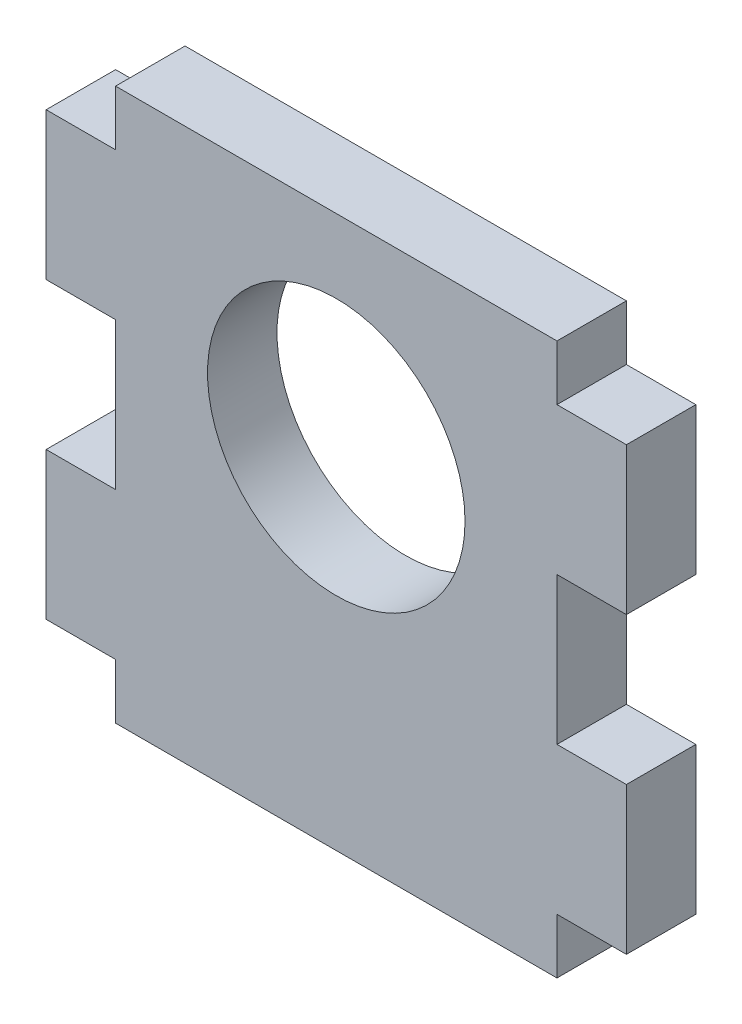
ISO-10303-21;
HEADER;
FILE_DESCRIPTION(('STEP AP214'),'2;1');
FILE_NAME('part.step','',(''),(''),'','','');
FILE_SCHEMA(('AUTOMOTIVE_DESIGN { 1 0 10303 214 1 1 1 1 }'));
ENDSEC;
DATA;
#1=APPLICATION_CONTEXT('core data for automotive mechanical design processes');
#2=APPLICATION_PROTOCOL_DEFINITION('international standard','automotive_design',2000,#1);
#3=PRODUCT_CONTEXT('',#1,'mechanical');
#4=PRODUCT('Part','Part','',(#3));
#5=PRODUCT_RELATED_PRODUCT_CATEGORY('part','',(#4));
#6=PRODUCT_DEFINITION_FORMATION('','',#4);
#7=PRODUCT_DEFINITION_CONTEXT('part definition',#1,'design');
#8=PRODUCT_DEFINITION('design','',#6,#7);
#9=PRODUCT_DEFINITION_SHAPE('','',#8);
#10=(LENGTH_UNIT() NAMED_UNIT(*) SI_UNIT(.MILLI.,.METRE.));
#11=(NAMED_UNIT(*) PLANE_ANGLE_UNIT() SI_UNIT($,.RADIAN.));
#12=(NAMED_UNIT(*) SI_UNIT($,.STERADIAN.) SOLID_ANGLE_UNIT());
#13=UNCERTAINTY_MEASURE_WITH_UNIT(LENGTH_MEASURE(1.E-05),#10,'distance_accuracy_value','');
#14=(GEOMETRIC_REPRESENTATION_CONTEXT(3) GLOBAL_UNCERTAINTY_ASSIGNED_CONTEXT((#13)) GLOBAL_UNIT_ASSIGNED_CONTEXT((#10,
#11,#12)) REPRESENTATION_CONTEXT('',''));
#15=CARTESIAN_POINT('',(0.,0.,0.));
#16=DIRECTION('',(0.,0.,1.));
#17=DIRECTION('',(1.,0.,0.));
#18=AXIS2_PLACEMENT_3D('',#15,#16,#17);
#19=CARTESIAN_POINT('',(0.,0.,5.9944));
#20=DIRECTION('',(0.,0.,1.));
#21=DIRECTION('',(1.,0.,0.));
#22=AXIS2_PLACEMENT_3D('',#19,#20,#21);
#23=PLANE('',#22);
#24=DIRECTION('',(1.,0.,0.));
#25=VECTOR('',#24,1.);
#26=CARTESIAN_POINT('',(-19.05,17.4625,5.9944));
#27=LINE('',#26,#25);
#28=CARTESIAN_POINT('',(-19.05,17.4625,5.9944));
#29=VERTEX_POINT('',#28);
#30=CARTESIAN_POINT('',(19.05,17.4625,5.9944));
#31=VERTEX_POINT('',#30);
#32=EDGE_CURVE('E176',#29,#31,#27,.T.);
#33=ORIENTED_EDGE('',*,*,#32,.F.);
#34=DIRECTION('',(0.,-1.,0.));
#35=VECTOR('',#34,1.);
#36=CARTESIAN_POINT('',(-19.05,19.05,5.9944));
#37=LINE('',#36,#35);
#38=CARTESIAN_POINT('',(-19.05,12.7,5.9944));
#39=VERTEX_POINT('',#38);
#40=EDGE_CURVE('E361',#29,#39,#37,.T.);
#41=ORIENTED_EDGE('',*,*,#40,.T.);
#42=DIRECTION('',(-1.,0.,0.));
#43=VECTOR('',#42,1.);
#44=CARTESIAN_POINT('',(-19.05,12.7,5.9944));
#45=LINE('',#44,#43);
#46=CARTESIAN_POINT('',(-25.0444,12.7,5.9944));
#47=VERTEX_POINT('',#46);
#48=EDGE_CURVE('E441',#39,#47,#45,.T.);
#49=ORIENTED_EDGE('',*,*,#48,.T.);
#50=DIRECTION('',(0.,-1.,0.));
#51=VECTOR('',#50,1.);
#52=CARTESIAN_POINT('',(-25.0444,12.7,5.9944));
#53=LINE('',#52,#51);
#54=CARTESIAN_POINT('',(-25.0444,0.,5.9944));
#55=VERTEX_POINT('',#54);
#56=EDGE_CURVE('E288',#47,#55,#53,.T.);
#57=ORIENTED_EDGE('',*,*,#56,.T.);
#58=DIRECTION('',(1.,0.,0.));
#59=VECTOR('',#58,1.);
#60=CARTESIAN_POINT('',(-19.05,0.,5.9944));
#61=LINE('',#60,#59);
#62=CARTESIAN_POINT('',(-19.05,0.,5.9944));
#63=VERTEX_POINT('',#62);
#64=EDGE_CURVE('E307',#55,#63,#61,.T.);
#65=ORIENTED_EDGE('',*,*,#64,.T.);
#66=DIRECTION('',(0.,-1.,0.));
#67=VECTOR('',#66,1.);
#68=CARTESIAN_POINT('',(-19.05,0.,5.9944));
#69=LINE('',#68,#67);
#70=CARTESIAN_POINT('',(-19.05,-12.7,5.9944));
#71=VERTEX_POINT('',#70);
#72=EDGE_CURVE('E302',#63,#71,#69,.T.);
#73=ORIENTED_EDGE('',*,*,#72,.T.);
#74=DIRECTION('',(-1.,0.,0.));
#75=VECTOR('',#74,1.);
#76=CARTESIAN_POINT('',(-19.05,-12.7,5.9944));
#77=LINE('',#76,#75);
#78=CARTESIAN_POINT('',(-25.0444,-12.7,5.9944));
#79=VERTEX_POINT('',#78);
#80=EDGE_CURVE('E306',#71,#79,#77,.T.);
#81=ORIENTED_EDGE('',*,*,#80,.T.);
#82=DIRECTION('',(0.,-1.,0.));
#83=VECTOR('',#82,1.);
#84=CARTESIAN_POINT('',(-25.0444,-25.4,5.9944));
#85=LINE('',#84,#83);
#86=CARTESIAN_POINT('',(-25.0444,-25.4,5.9944));
#87=VERTEX_POINT('',#86);
#88=EDGE_CURVE('E311',#79,#87,#85,.T.);
#89=ORIENTED_EDGE('',*,*,#88,.T.);
#90=DIRECTION('',(1.,0.,0.));
#91=VECTOR('',#90,1.);
#92=CARTESIAN_POINT('',(-19.05,-25.4,5.9944));
#93=LINE('',#92,#91);
#94=CARTESIAN_POINT('',(-19.05,-25.4,5.9944));
#95=VERTEX_POINT('',#94);
#96=EDGE_CURVE('E329',#87,#95,#93,.T.);
#97=ORIENTED_EDGE('',*,*,#96,.T.);
#98=DIRECTION('',(0.,-1.,0.));
#99=VECTOR('',#98,1.);
#100=CARTESIAN_POINT('',(-19.05,-25.4,5.9944));
#101=LINE('',#100,#99);
#102=CARTESIAN_POINT('',(-19.05,-30.1625,5.9944));
#103=VERTEX_POINT('',#102);
#104=EDGE_CURVE('E333',#95,#103,#101,.T.);
#105=ORIENTED_EDGE('',*,*,#104,.T.);
#106=DIRECTION('',(-1.,0.,0.));
#107=VECTOR('',#106,1.);
#108=CARTESIAN_POINT('',(-19.05,-30.1625,5.9944));
#109=LINE('',#108,#107);
#110=CARTESIAN_POINT('',(19.05,-30.1625,5.9944));
#111=VERTEX_POINT('',#110);
#112=EDGE_CURVE('E181',#111,#103,#109,.T.);
#113=ORIENTED_EDGE('',*,*,#112,.F.);
#114=DIRECTION('',(0.,1.,0.));
#115=VECTOR('',#114,1.);
#116=CARTESIAN_POINT('',(19.05,-25.4,5.9944));
#117=LINE('',#116,#115);
#118=CARTESIAN_POINT('',(19.05,-25.4,5.9944));
#119=VERTEX_POINT('',#118);
#120=EDGE_CURVE('E338',#111,#119,#117,.T.);
#121=ORIENTED_EDGE('',*,*,#120,.T.);
#122=DIRECTION('',(1.,0.,0.));
#123=VECTOR('',#122,1.);
#124=CARTESIAN_POINT('',(19.05,-25.4,5.9944));
#125=LINE('',#124,#123);
#126=CARTESIAN_POINT('',(25.0444,-25.4,5.9944));
#127=VERTEX_POINT('',#126);
#128=EDGE_CURVE('E388',#119,#127,#125,.T.);
#129=ORIENTED_EDGE('',*,*,#128,.T.);
#130=DIRECTION('',(0.,1.,0.));
#131=VECTOR('',#130,1.);
#132=CARTESIAN_POINT('',(25.0444,-25.4,5.9944));
#133=LINE('',#132,#131);
#134=CARTESIAN_POINT('',(25.0444,-12.7,5.9944));
#135=VERTEX_POINT('',#134);
#136=EDGE_CURVE('E385',#127,#135,#133,.T.);
#137=ORIENTED_EDGE('',*,*,#136,.T.);
#138=DIRECTION('',(-1.,0.,0.));
#139=VECTOR('',#138,1.);
#140=CARTESIAN_POINT('',(19.05,-12.7,5.9944));
#141=LINE('',#140,#139);
#142=CARTESIAN_POINT('',(19.05,-12.7,5.9944));
#143=VERTEX_POINT('',#142);
#144=EDGE_CURVE('E380',#135,#143,#141,.T.);
#145=ORIENTED_EDGE('',*,*,#144,.T.);
#146=DIRECTION('',(0.,1.,0.));
#147=VECTOR('',#146,1.);
#148=CARTESIAN_POINT('',(19.05,0.,5.9944));
#149=LINE('',#148,#147);
#150=CARTESIAN_POINT('',(19.05,0.,5.9944));
#151=VERTEX_POINT('',#150);
#152=EDGE_CURVE('E376',#143,#151,#149,.T.);
#153=ORIENTED_EDGE('',*,*,#152,.T.);
#154=DIRECTION('',(1.,0.,0.));
#155=VECTOR('',#154,1.);
#156=CARTESIAN_POINT('',(19.05,0.,5.9944));
#157=LINE('',#156,#155);
#158=CARTESIAN_POINT('',(25.0444,0.,5.9944));
#159=VERTEX_POINT('',#158);
#160=EDGE_CURVE('E372',#151,#159,#157,.T.);
#161=ORIENTED_EDGE('',*,*,#160,.T.);
#162=DIRECTION('',(0.,1.,0.));
#163=VECTOR('',#162,1.);
#164=CARTESIAN_POINT('',(25.0444,12.7,5.9944));
#165=LINE('',#164,#163);
#166=CARTESIAN_POINT('',(25.0444,12.7,5.9944));
#167=VERTEX_POINT('',#166);
#168=EDGE_CURVE('E369',#159,#167,#165,.T.);
#169=ORIENTED_EDGE('',*,*,#168,.T.);
#170=DIRECTION('',(-1.,0.,0.));
#171=VECTOR('',#170,1.);
#172=CARTESIAN_POINT('',(19.05,12.7,5.9944));
#173=LINE('',#172,#171);
#174=CARTESIAN_POINT('',(19.05,12.7,5.9944));
#175=VERTEX_POINT('',#174);
#176=EDGE_CURVE('E205',#167,#175,#173,.T.);
#177=ORIENTED_EDGE('',*,*,#176,.T.);
#178=DIRECTION('',(0.,1.,0.));
#179=VECTOR('',#178,1.);
#180=CARTESIAN_POINT('',(19.05,19.05,5.9944));
#181=LINE('',#180,#179);
#182=EDGE_CURVE('E241',#175,#31,#181,.T.);
#183=ORIENTED_EDGE('',*,*,#182,.T.);
#184=EDGE_LOOP('',(#33,#41,#49,#57,#65,#73,#81,#89,#97,#105,#113,#121,#129,#137,#145,#153,#161,
#169,#177,#183));
#185=FACE_BOUND('',#184,.T.);
#186=CARTESIAN_POINT('',(0.,0.,5.9944));
#187=DIRECTION('',(0.,0.,1.));
#188=DIRECTION('',(1.,0.,0.));
#189=AXIS2_PLACEMENT_3D('',#186,#187,#188);
#190=CIRCLE('',#189,11.1125);
#191=CARTESIAN_POINT('',(11.1125,0.,5.9944));
#192=VERTEX_POINT('',#191);
#193=EDGE_CURVE('E197',#192,#192,#190,.T.);
#194=ORIENTED_EDGE('',*,*,#193,.F.);
#195=EDGE_LOOP('',(#194));
#196=FACE_BOUND('',#195,.T.);
#197=ADVANCED_FACE('F38',(#185,#196),#23,.T.);
#198=CARTESIAN_POINT('',(0.,0.,0.));
#199=DIRECTION('',(0.,0.,1.));
#200=DIRECTION('',(1.,0.,0.));
#201=AXIS2_PLACEMENT_3D('',#198,#199,#200);
#202=PLANE('',#201);
#203=DIRECTION('',(0.,-1.,0.));
#204=VECTOR('',#203,1.);
#205=CARTESIAN_POINT('',(-19.05,19.05,0.));
#206=LINE('',#205,#204);
#207=CARTESIAN_POINT('',(-19.05,17.4625,0.));
#208=VERTEX_POINT('',#207);
#209=CARTESIAN_POINT('',(-19.05,12.7,0.));
#210=VERTEX_POINT('',#209);
#211=EDGE_CURVE('E192',#208,#210,#206,.T.);
#212=ORIENTED_EDGE('',*,*,#211,.F.);
#213=DIRECTION('',(1.,0.,0.));
#214=VECTOR('',#213,1.);
#215=CARTESIAN_POINT('',(-19.05,17.4625,0.));
#216=LINE('',#215,#214);
#217=CARTESIAN_POINT('',(19.05,17.4625,0.));
#218=VERTEX_POINT('',#217);
#219=EDGE_CURVE('E53',#208,#218,#216,.T.);
#220=ORIENTED_EDGE('',*,*,#219,.T.);
#221=DIRECTION('',(0.,1.,0.));
#222=VECTOR('',#221,1.);
#223=CARTESIAN_POINT('',(19.05,19.05,0.));
#224=LINE('',#223,#222);
#225=CARTESIAN_POINT('',(19.05,12.7,0.));
#226=VERTEX_POINT('',#225);
#227=EDGE_CURVE('E190',#226,#218,#224,.T.);
#228=ORIENTED_EDGE('',*,*,#227,.F.);
#229=DIRECTION('',(-1.,0.,0.));
#230=VECTOR('',#229,1.);
#231=CARTESIAN_POINT('',(19.05,12.7,0.));
#232=LINE('',#231,#230);
#233=CARTESIAN_POINT('',(25.0444,12.7,0.));
#234=VERTEX_POINT('',#233);
#235=EDGE_CURVE('E239',#234,#226,#232,.T.);
#236=ORIENTED_EDGE('',*,*,#235,.F.);
#237=DIRECTION('',(0.,1.,0.));
#238=VECTOR('',#237,1.);
#239=CARTESIAN_POINT('',(25.0444,12.7,0.));
#240=LINE('',#239,#238);
#241=CARTESIAN_POINT('',(25.0444,0.,0.));
#242=VERTEX_POINT('',#241);
#243=EDGE_CURVE('E237',#242,#234,#240,.T.);
#244=ORIENTED_EDGE('',*,*,#243,.F.);
#245=DIRECTION('',(1.,0.,0.));
#246=VECTOR('',#245,1.);
#247=CARTESIAN_POINT('',(19.05,0.,0.));
#248=LINE('',#247,#246);
#249=CARTESIAN_POINT('',(19.05,0.,0.));
#250=VERTEX_POINT('',#249);
#251=EDGE_CURVE('E235',#250,#242,#248,.T.);
#252=ORIENTED_EDGE('',*,*,#251,.F.);
#253=DIRECTION('',(0.,1.,0.));
#254=VECTOR('',#253,1.);
#255=CARTESIAN_POINT('',(19.05,0.,0.));
#256=LINE('',#255,#254);
#257=CARTESIAN_POINT('',(19.05,-12.7,0.));
#258=VERTEX_POINT('',#257);
#259=EDGE_CURVE('E233',#258,#250,#256,.T.);
#260=ORIENTED_EDGE('',*,*,#259,.F.);
#261=DIRECTION('',(-1.,0.,0.));
#262=VECTOR('',#261,1.);
#263=CARTESIAN_POINT('',(19.05,-12.7,0.));
#264=LINE('',#263,#262);
#265=CARTESIAN_POINT('',(25.0444,-12.7,0.));
#266=VERTEX_POINT('',#265);
#267=EDGE_CURVE('E231',#266,#258,#264,.T.);
#268=ORIENTED_EDGE('',*,*,#267,.F.);
#269=DIRECTION('',(0.,1.,0.));
#270=VECTOR('',#269,1.);
#271=CARTESIAN_POINT('',(25.0444,-25.4,0.));
#272=LINE('',#271,#270);
#273=CARTESIAN_POINT('',(25.0444,-25.4,0.));
#274=VERTEX_POINT('',#273);
#275=EDGE_CURVE('E229',#274,#266,#272,.T.);
#276=ORIENTED_EDGE('',*,*,#275,.F.);
#277=DIRECTION('',(1.,0.,0.));
#278=VECTOR('',#277,1.);
#279=CARTESIAN_POINT('',(19.05,-25.4,0.));
#280=LINE('',#279,#278);
#281=CARTESIAN_POINT('',(19.05,-25.4,0.));
#282=VERTEX_POINT('',#281);
#283=EDGE_CURVE('E227',#282,#274,#280,.T.);
#284=ORIENTED_EDGE('',*,*,#283,.F.);
#285=DIRECTION('',(0.,1.,0.));
#286=VECTOR('',#285,1.);
#287=CARTESIAN_POINT('',(19.05,-25.4,0.));
#288=LINE('',#287,#286);
#289=CARTESIAN_POINT('',(19.05,-30.1625,0.));
#290=VERTEX_POINT('',#289);
#291=EDGE_CURVE('E225',#290,#282,#288,.T.);
#292=ORIENTED_EDGE('',*,*,#291,.F.);
#293=DIRECTION('',(-1.,0.,0.));
#294=VECTOR('',#293,1.);
#295=CARTESIAN_POINT('',(-19.05,-30.1625,0.));
#296=LINE('',#295,#294);
#297=CARTESIAN_POINT('',(-19.05,-30.1625,0.));
#298=VERTEX_POINT('',#297);
#299=EDGE_CURVE('E61',#290,#298,#296,.T.);
#300=ORIENTED_EDGE('',*,*,#299,.T.);
#301=DIRECTION('',(0.,-1.,0.));
#302=VECTOR('',#301,1.);
#303=CARTESIAN_POINT('',(-19.05,-25.4,0.));
#304=LINE('',#303,#302);
#305=CARTESIAN_POINT('',(-19.05,-25.4,0.));
#306=VERTEX_POINT('',#305);
#307=EDGE_CURVE('E222',#306,#298,#304,.T.);
#308=ORIENTED_EDGE('',*,*,#307,.F.);
#309=DIRECTION('',(1.,0.,0.));
#310=VECTOR('',#309,1.);
#311=CARTESIAN_POINT('',(-19.05,-25.4,0.));
#312=LINE('',#311,#310);
#313=CARTESIAN_POINT('',(-25.0444,-25.4,0.));
#314=VERTEX_POINT('',#313);
#315=EDGE_CURVE('E220',#314,#306,#312,.T.);
#316=ORIENTED_EDGE('',*,*,#315,.F.);
#317=DIRECTION('',(0.,-1.,0.));
#318=VECTOR('',#317,1.);
#319=CARTESIAN_POINT('',(-25.0444,-25.4,0.));
#320=LINE('',#319,#318);
#321=CARTESIAN_POINT('',(-25.0444,-12.7,0.));
#322=VERTEX_POINT('',#321);
#323=EDGE_CURVE('E218',#322,#314,#320,.T.);
#324=ORIENTED_EDGE('',*,*,#323,.F.);
#325=DIRECTION('',(-1.,0.,0.));
#326=VECTOR('',#325,1.);
#327=CARTESIAN_POINT('',(-19.05,-12.7,0.));
#328=LINE('',#327,#326);
#329=CARTESIAN_POINT('',(-19.05,-12.7,0.));
#330=VERTEX_POINT('',#329);
#331=EDGE_CURVE('E216',#330,#322,#328,.T.);
#332=ORIENTED_EDGE('',*,*,#331,.F.);
#333=DIRECTION('',(0.,-1.,0.));
#334=VECTOR('',#333,1.);
#335=CARTESIAN_POINT('',(-19.05,0.,0.));
#336=LINE('',#335,#334);
#337=CARTESIAN_POINT('',(-19.05,0.,0.));
#338=VERTEX_POINT('',#337);
#339=EDGE_CURVE('E214',#338,#330,#336,.T.);
#340=ORIENTED_EDGE('',*,*,#339,.F.);
#341=DIRECTION('',(1.,0.,0.));
#342=VECTOR('',#341,1.);
#343=CARTESIAN_POINT('',(-19.05,0.,0.));
#344=LINE('',#343,#342);
#345=CARTESIAN_POINT('',(-25.0444,0.,0.));
#346=VERTEX_POINT('',#345);
#347=EDGE_CURVE('E212',#346,#338,#344,.T.);
#348=ORIENTED_EDGE('',*,*,#347,.F.);
#349=DIRECTION('',(0.,-1.,0.));
#350=VECTOR('',#349,1.);
#351=CARTESIAN_POINT('',(-25.0444,12.7,0.));
#352=LINE('',#351,#350);
#353=CARTESIAN_POINT('',(-25.0444,12.7,0.));
#354=VERTEX_POINT('',#353);
#355=EDGE_CURVE('E210',#354,#346,#352,.T.);
#356=ORIENTED_EDGE('',*,*,#355,.F.);
#357=DIRECTION('',(-1.,0.,0.));
#358=VECTOR('',#357,1.);
#359=CARTESIAN_POINT('',(-19.05,12.7,0.));
#360=LINE('',#359,#358);
#361=EDGE_CURVE('E199',#210,#354,#360,.T.);
#362=ORIENTED_EDGE('',*,*,#361,.F.);
#363=EDGE_LOOP('',(#212,#220,#228,#236,#244,#252,#260,#268,#276,#284,#292,#300,#308,#316,#324,
#332,#340,#348,#356,#362));
#364=FACE_BOUND('',#363,.T.);
#365=CARTESIAN_POINT('',(0.,0.,0.));
#366=DIRECTION('',(0.,0.,1.));
#367=DIRECTION('',(1.,0.,0.));
#368=AXIS2_PLACEMENT_3D('',#365,#366,#367);
#369=CIRCLE('',#368,11.1125);
#370=CARTESIAN_POINT('',(11.1125,0.,0.));
#371=VERTEX_POINT('',#370);
#372=EDGE_CURVE('E203',#371,#371,#369,.T.);
#373=ORIENTED_EDGE('',*,*,#372,.T.);
#374=EDGE_LOOP('',(#373));
#375=FACE_BOUND('',#374,.T.);
#376=ADVANCED_FACE('F187',(#364,#375),#202,.F.);
#377=CARTESIAN_POINT('',(19.05,19.05,5.9944));
#378=DIRECTION('',(-1.,0.,0.));
#379=DIRECTION('',(0.,-1.,0.));
#380=AXIS2_PLACEMENT_3D('',#377,#378,#379);
#381=PLANE('',#380);
#382=ORIENTED_EDGE('',*,*,#227,.T.);
#383=DIRECTION('',(0.,0.,1.));
#384=VECTOR('',#383,1.);
#385=CARTESIAN_POINT('',(19.05,17.4625,0.));
#386=LINE('',#385,#384);
#387=EDGE_CURVE('E173',#218,#31,#386,.T.);
#388=ORIENTED_EDGE('',*,*,#387,.T.);
#389=ORIENTED_EDGE('',*,*,#182,.F.);
#390=DIRECTION('',(0.,0.,-1.));
#391=VECTOR('',#390,1.);
#392=CARTESIAN_POINT('',(19.05,12.7,5.9944));
#393=LINE('',#392,#391);
#394=EDGE_CURVE('E196',#175,#226,#393,.T.);
#395=ORIENTED_EDGE('',*,*,#394,.T.);
#396=EDGE_LOOP('',(#382,#388,#389,#395));
#397=FACE_BOUND('',#396,.T.);
#398=ADVANCED_FACE('F40',(#397),#381,.F.);
#399=CARTESIAN_POINT('',(-19.05,19.05,5.9944));
#400=DIRECTION('',(1.,0.,0.));
#401=DIRECTION('',(0.,1.,0.));
#402=AXIS2_PLACEMENT_3D('',#399,#400,#401);
#403=PLANE('',#402);
#404=ORIENTED_EDGE('',*,*,#40,.F.);
#405=DIRECTION('',(0.,0.,1.));
#406=VECTOR('',#405,1.);
#407=CARTESIAN_POINT('',(-19.05,17.4625,0.));
#408=LINE('',#407,#406);
#409=EDGE_CURVE('E182',#208,#29,#408,.T.);
#410=ORIENTED_EDGE('',*,*,#409,.F.);
#411=ORIENTED_EDGE('',*,*,#211,.T.);
#412=DIRECTION('',(0.,0.,-1.));
#413=VECTOR('',#412,1.);
#414=CARTESIAN_POINT('',(-19.05,12.7,5.9944));
#415=LINE('',#414,#413);
#416=EDGE_CURVE('E12',#39,#210,#415,.T.);
#417=ORIENTED_EDGE('',*,*,#416,.F.);
#418=EDGE_LOOP('',(#404,#410,#411,#417));
#419=FACE_BOUND('',#418,.T.);
#420=ADVANCED_FACE('F439',(#419),#403,.F.);
#421=CARTESIAN_POINT('',(-19.05,12.7,5.9944));
#422=DIRECTION('',(0.,-1.,0.));
#423=DIRECTION('',(0.,0.,-1.));
#424=AXIS2_PLACEMENT_3D('',#421,#422,#423);
#425=PLANE('',#424);
#426=ORIENTED_EDGE('',*,*,#361,.T.);
#427=DIRECTION('',(0.,0.,-1.));
#428=VECTOR('',#427,1.);
#429=CARTESIAN_POINT('',(-25.0444,12.7,5.9944));
#430=LINE('',#429,#428);
#431=EDGE_CURVE('E46',#47,#354,#430,.T.);
#432=ORIENTED_EDGE('',*,*,#431,.F.);
#433=ORIENTED_EDGE('',*,*,#48,.F.);
#434=ORIENTED_EDGE('',*,*,#416,.T.);
#435=EDGE_LOOP('',(#426,#432,#433,#434));
#436=FACE_BOUND('',#435,.T.);
#437=ADVANCED_FACE('F450',(#436),#425,.F.);
#438=CARTESIAN_POINT('',(-25.0444,12.7,5.9944));
#439=DIRECTION('',(1.,0.,0.));
#440=DIRECTION('',(0.,0.,-1.));
#441=AXIS2_PLACEMENT_3D('',#438,#439,#440);
#442=PLANE('',#441);
#443=ORIENTED_EDGE('',*,*,#355,.T.);
#444=DIRECTION('',(0.,0.,-1.));
#445=VECTOR('',#444,1.);
#446=CARTESIAN_POINT('',(-25.0444,0.,5.9944));
#447=LINE('',#446,#445);
#448=EDGE_CURVE('E279',#55,#346,#447,.T.);
#449=ORIENTED_EDGE('',*,*,#448,.F.);
#450=ORIENTED_EDGE('',*,*,#56,.F.);
#451=ORIENTED_EDGE('',*,*,#431,.T.);
#452=EDGE_LOOP('',(#443,#449,#450,#451));
#453=FACE_BOUND('',#452,.T.);
#454=ADVANCED_FACE('F286',(#453),#442,.F.);
#455=CARTESIAN_POINT('',(-19.05,0.,5.9944));
#456=DIRECTION('',(0.,1.,0.));
#457=DIRECTION('',(0.,0.,1.));
#458=AXIS2_PLACEMENT_3D('',#455,#456,#457);
#459=PLANE('',#458);
#460=ORIENTED_EDGE('',*,*,#347,.T.);
#461=DIRECTION('',(0.,0.,-1.));
#462=VECTOR('',#461,1.);
#463=CARTESIAN_POINT('',(-19.05,0.,5.9944));
#464=LINE('',#463,#462);
#465=EDGE_CURVE('E276',#63,#338,#464,.T.);
#466=ORIENTED_EDGE('',*,*,#465,.F.);
#467=ORIENTED_EDGE('',*,*,#64,.F.);
#468=ORIENTED_EDGE('',*,*,#448,.T.);
#469=EDGE_LOOP('',(#460,#466,#467,#468));
#470=FACE_BOUND('',#469,.T.);
#471=ADVANCED_FACE('F296',(#470),#459,.F.);
#472=CARTESIAN_POINT('',(-19.05,0.,5.9944));
#473=DIRECTION('',(1.,0.,0.));
#474=DIRECTION('',(0.,0.,-1.));
#475=AXIS2_PLACEMENT_3D('',#472,#473,#474);
#476=PLANE('',#475);
#477=ORIENTED_EDGE('',*,*,#339,.T.);
#478=DIRECTION('',(0.,0.,-1.));
#479=VECTOR('',#478,1.);
#480=CARTESIAN_POINT('',(-19.05,-12.7,5.9944));
#481=LINE('',#480,#479);
#482=EDGE_CURVE('E273',#71,#330,#481,.T.);
#483=ORIENTED_EDGE('',*,*,#482,.F.);
#484=ORIENTED_EDGE('',*,*,#72,.F.);
#485=ORIENTED_EDGE('',*,*,#465,.T.);
#486=EDGE_LOOP('',(#477,#483,#484,#485));
#487=FACE_BOUND('',#486,.T.);
#488=ADVANCED_FACE('F300',(#487),#476,.F.);
#489=CARTESIAN_POINT('',(-19.05,-12.7,5.9944));
#490=DIRECTION('',(0.,-1.,0.));
#491=DIRECTION('',(0.,0.,-1.));
#492=AXIS2_PLACEMENT_3D('',#489,#490,#491);
#493=PLANE('',#492);
#494=ORIENTED_EDGE('',*,*,#331,.T.);
#495=DIRECTION('',(0.,0.,-1.));
#496=VECTOR('',#495,1.);
#497=CARTESIAN_POINT('',(-25.0444,-12.7,5.9944));
#498=LINE('',#497,#496);
#499=EDGE_CURVE('E270',#79,#322,#498,.T.);
#500=ORIENTED_EDGE('',*,*,#499,.F.);
#501=ORIENTED_EDGE('',*,*,#80,.F.);
#502=ORIENTED_EDGE('',*,*,#482,.T.);
#503=EDGE_LOOP('',(#494,#500,#501,#502));
#504=FACE_BOUND('',#503,.T.);
#505=ADVANCED_FACE('F495',(#504),#493,.F.);
#506=CARTESIAN_POINT('',(-25.0444,-25.4,5.9944));
#507=DIRECTION('',(1.,0.,0.));
#508=DIRECTION('',(0.,0.,-1.));
#509=AXIS2_PLACEMENT_3D('',#506,#507,#508);
#510=PLANE('',#509);
#511=ORIENTED_EDGE('',*,*,#323,.T.);
#512=DIRECTION('',(0.,0.,-1.));
#513=VECTOR('',#512,1.);
#514=CARTESIAN_POINT('',(-25.0444,-25.4,5.9944));
#515=LINE('',#514,#513);
#516=EDGE_CURVE('E267',#87,#314,#515,.T.);
#517=ORIENTED_EDGE('',*,*,#516,.F.);
#518=ORIENTED_EDGE('',*,*,#88,.F.);
#519=ORIENTED_EDGE('',*,*,#499,.T.);
#520=EDGE_LOOP('',(#511,#517,#518,#519));
#521=FACE_BOUND('',#520,.T.);
#522=ADVANCED_FACE('F491',(#521),#510,.F.);
#523=CARTESIAN_POINT('',(-19.05,-25.4,5.9944));
#524=DIRECTION('',(0.,1.,0.));
#525=DIRECTION('',(0.,0.,1.));
#526=AXIS2_PLACEMENT_3D('',#523,#524,#525);
#527=PLANE('',#526);
#528=ORIENTED_EDGE('',*,*,#315,.T.);
#529=DIRECTION('',(0.,0.,-1.));
#530=VECTOR('',#529,1.);
#531=CARTESIAN_POINT('',(-19.05,-25.4,5.9944));
#532=LINE('',#531,#530);
#533=EDGE_CURVE('E264',#95,#306,#532,.T.);
#534=ORIENTED_EDGE('',*,*,#533,.F.);
#535=ORIENTED_EDGE('',*,*,#96,.F.);
#536=ORIENTED_EDGE('',*,*,#516,.T.);
#537=EDGE_LOOP('',(#528,#534,#535,#536));
#538=FACE_BOUND('',#537,.T.);
#539=ADVANCED_FACE('F487',(#538),#527,.F.);
#540=CARTESIAN_POINT('',(-19.05,-25.4,5.9944));
#541=DIRECTION('',(1.,0.,0.));
#542=DIRECTION('',(0.,1.,0.));
#543=AXIS2_PLACEMENT_3D('',#540,#541,#542);
#544=PLANE('',#543);
#545=ORIENTED_EDGE('',*,*,#307,.T.);
#546=DIRECTION('',(0.,0.,1.));
#547=VECTOR('',#546,1.);
#548=CARTESIAN_POINT('',(-19.05,-30.1625,0.));
#549=LINE('',#548,#547);
#550=EDGE_CURVE('E350',#298,#103,#549,.T.);
#551=ORIENTED_EDGE('',*,*,#550,.T.);
#552=ORIENTED_EDGE('',*,*,#104,.F.);
#553=ORIENTED_EDGE('',*,*,#533,.T.);
#554=EDGE_LOOP('',(#545,#551,#552,#553));
#555=FACE_BOUND('',#554,.T.);
#556=ADVANCED_FACE('F484',(#555),#544,.F.);
#557=CARTESIAN_POINT('',(19.05,-25.4,5.9944));
#558=DIRECTION('',(-1.,0.,0.));
#559=DIRECTION('',(0.,-1.,0.));
#560=AXIS2_PLACEMENT_3D('',#557,#558,#559);
#561=PLANE('',#560);
#562=ORIENTED_EDGE('',*,*,#120,.F.);
#563=DIRECTION('',(0.,0.,1.));
#564=VECTOR('',#563,1.);
#565=CARTESIAN_POINT('',(19.05,-30.1625,0.));
#566=LINE('',#565,#564);
#567=EDGE_CURVE('E353',#290,#111,#566,.T.);
#568=ORIENTED_EDGE('',*,*,#567,.F.);
#569=ORIENTED_EDGE('',*,*,#291,.T.);
#570=DIRECTION('',(0.,0.,-1.));
#571=VECTOR('',#570,1.);
#572=CARTESIAN_POINT('',(19.05,-25.4,5.9944));
#573=LINE('',#572,#571);
#574=EDGE_CURVE('E261',#119,#282,#573,.T.);
#575=ORIENTED_EDGE('',*,*,#574,.F.);
#576=EDGE_LOOP('',(#562,#568,#569,#575));
#577=FACE_BOUND('',#576,.T.);
#578=ADVANCED_FACE('F399',(#577),#561,.F.);
#579=CARTESIAN_POINT('',(19.05,-25.4,5.9944));
#580=DIRECTION('',(0.,1.,0.));
#581=DIRECTION('',(0.,0.,1.));
#582=AXIS2_PLACEMENT_3D('',#579,#580,#581);
#583=PLANE('',#582);
#584=ORIENTED_EDGE('',*,*,#283,.T.);
#585=DIRECTION('',(0.,0.,-1.));
#586=VECTOR('',#585,1.);
#587=CARTESIAN_POINT('',(25.0444,-25.4,5.9944));
#588=LINE('',#587,#586);
#589=EDGE_CURVE('E258',#127,#274,#588,.T.);
#590=ORIENTED_EDGE('',*,*,#589,.F.);
#591=ORIENTED_EDGE('',*,*,#128,.F.);
#592=ORIENTED_EDGE('',*,*,#574,.T.);
#593=EDGE_LOOP('',(#584,#590,#591,#592));
#594=FACE_BOUND('',#593,.T.);
#595=ADVANCED_FACE('F403',(#594),#583,.F.);
#596=CARTESIAN_POINT('',(25.0444,-25.4,5.9944));
#597=DIRECTION('',(-1.,0.,0.));
#598=DIRECTION('',(0.,-1.,0.));
#599=AXIS2_PLACEMENT_3D('',#596,#597,#598);
#600=PLANE('',#599);
#601=ORIENTED_EDGE('',*,*,#275,.T.);
#602=DIRECTION('',(0.,0.,-1.));
#603=VECTOR('',#602,1.);
#604=CARTESIAN_POINT('',(25.0444,-12.7,5.9944));
#605=LINE('',#604,#603);
#606=EDGE_CURVE('E255',#135,#266,#605,.T.);
#607=ORIENTED_EDGE('',*,*,#606,.F.);
#608=ORIENTED_EDGE('',*,*,#136,.F.);
#609=ORIENTED_EDGE('',*,*,#589,.T.);
#610=EDGE_LOOP('',(#601,#607,#608,#609));
#611=FACE_BOUND('',#610,.T.);
#612=ADVANCED_FACE('F408',(#611),#600,.F.);
#613=CARTESIAN_POINT('',(19.05,-12.7,5.9944));
#614=DIRECTION('',(0.,-1.,0.));
#615=DIRECTION('',(0.,0.,-1.));
#616=AXIS2_PLACEMENT_3D('',#613,#614,#615);
#617=PLANE('',#616);
#618=ORIENTED_EDGE('',*,*,#267,.T.);
#619=DIRECTION('',(0.,0.,-1.));
#620=VECTOR('',#619,1.);
#621=CARTESIAN_POINT('',(19.05,-12.7,5.9944));
#622=LINE('',#621,#620);
#623=EDGE_CURVE('E252',#143,#258,#622,.T.);
#624=ORIENTED_EDGE('',*,*,#623,.F.);
#625=ORIENTED_EDGE('',*,*,#144,.F.);
#626=ORIENTED_EDGE('',*,*,#606,.T.);
#627=EDGE_LOOP('',(#618,#624,#625,#626));
#628=FACE_BOUND('',#627,.T.);
#629=ADVANCED_FACE('F415',(#628),#617,.F.);
#630=CARTESIAN_POINT('',(19.05,0.,5.9944));
#631=DIRECTION('',(-1.,0.,0.));
#632=DIRECTION('',(0.,0.,1.));
#633=AXIS2_PLACEMENT_3D('',#630,#631,#632);
#634=PLANE('',#633);
#635=ORIENTED_EDGE('',*,*,#259,.T.);
#636=DIRECTION('',(0.,0.,-1.));
#637=VECTOR('',#636,1.);
#638=CARTESIAN_POINT('',(19.05,0.,5.9944));
#639=LINE('',#638,#637);
#640=EDGE_CURVE('E249',#151,#250,#639,.T.);
#641=ORIENTED_EDGE('',*,*,#640,.F.);
#642=ORIENTED_EDGE('',*,*,#152,.F.);
#643=ORIENTED_EDGE('',*,*,#623,.T.);
#644=EDGE_LOOP('',(#635,#641,#642,#643));
#645=FACE_BOUND('',#644,.T.);
#646=ADVANCED_FACE('F419',(#645),#634,.F.);
#647=CARTESIAN_POINT('',(19.05,0.,5.9944));
#648=DIRECTION('',(0.,1.,0.));
#649=DIRECTION('',(0.,0.,1.));
#650=AXIS2_PLACEMENT_3D('',#647,#648,#649);
#651=PLANE('',#650);
#652=ORIENTED_EDGE('',*,*,#251,.T.);
#653=DIRECTION('',(0.,0.,-1.));
#654=VECTOR('',#653,1.);
#655=CARTESIAN_POINT('',(25.0444,0.,5.9944));
#656=LINE('',#655,#654);
#657=EDGE_CURVE('E246',#159,#242,#656,.T.);
#658=ORIENTED_EDGE('',*,*,#657,.F.);
#659=ORIENTED_EDGE('',*,*,#160,.F.);
#660=ORIENTED_EDGE('',*,*,#640,.T.);
#661=EDGE_LOOP('',(#652,#658,#659,#660));
#662=FACE_BOUND('',#661,.T.);
#663=ADVANCED_FACE('F424',(#662),#651,.F.);
#664=CARTESIAN_POINT('',(25.0444,12.7,5.9944));
#665=DIRECTION('',(-1.,0.,0.));
#666=DIRECTION('',(0.,-1.,0.));
#667=AXIS2_PLACEMENT_3D('',#664,#665,#666);
#668=PLANE('',#667);
#669=ORIENTED_EDGE('',*,*,#243,.T.);
#670=DIRECTION('',(0.,0.,-1.));
#671=VECTOR('',#670,1.);
#672=CARTESIAN_POINT('',(25.0444,12.7,5.9944));
#673=LINE('',#672,#671);
#674=EDGE_CURVE('E243',#167,#234,#673,.T.);
#675=ORIENTED_EDGE('',*,*,#674,.F.);
#676=ORIENTED_EDGE('',*,*,#168,.F.);
#677=ORIENTED_EDGE('',*,*,#657,.T.);
#678=EDGE_LOOP('',(#669,#675,#676,#677));
#679=FACE_BOUND('',#678,.T.);
#680=ADVANCED_FACE('F429',(#679),#668,.F.);
#681=CARTESIAN_POINT('',(19.05,12.7,5.9944));
#682=DIRECTION('',(0.,-1.,0.));
#683=DIRECTION('',(1.,0.,0.));
#684=AXIS2_PLACEMENT_3D('',#681,#682,#683);
#685=PLANE('',#684);
#686=ORIENTED_EDGE('',*,*,#235,.T.);
#687=ORIENTED_EDGE('',*,*,#394,.F.);
#688=ORIENTED_EDGE('',*,*,#176,.F.);
#689=ORIENTED_EDGE('',*,*,#674,.T.);
#690=EDGE_LOOP('',(#686,#687,#688,#689));
#691=FACE_BOUND('',#690,.T.);
#692=ADVANCED_FACE('F432',(#691),#685,.F.);
#693=CARTESIAN_POINT('',(0.,0.,5.9944));
#694=DIRECTION('',(0.,0.,-1.));
#695=DIRECTION('',(-1.,0.,0.));
#696=AXIS2_PLACEMENT_3D('',#693,#694,#695);
#697=CYLINDRICAL_SURFACE('',#696,11.1125);
#698=ORIENTED_EDGE('',*,*,#193,.T.);
#699=EDGE_LOOP('',(#698));
#700=FACE_BOUND('',#699,.T.);
#701=ORIENTED_EDGE('',*,*,#372,.F.);
#702=EDGE_LOOP('',(#701));
#703=FACE_BOUND('',#702,.T.);
#704=ADVANCED_FACE('F465',(#700,#703),#697,.F.);
#705=CARTESIAN_POINT('',(-19.05,-30.1625,0.));
#706=DIRECTION('',(0.,1.,0.));
#707=DIRECTION('',(0.,0.,1.));
#708=AXIS2_PLACEMENT_3D('',#705,#706,#707);
#709=PLANE('',#708);
#710=ORIENTED_EDGE('',*,*,#112,.T.);
#711=ORIENTED_EDGE('',*,*,#550,.F.);
#712=ORIENTED_EDGE('',*,*,#299,.F.);
#713=ORIENTED_EDGE('',*,*,#567,.T.);
#714=EDGE_LOOP('',(#710,#711,#712,#713));
#715=FACE_BOUND('',#714,.T.);
#716=ADVANCED_FACE('F567',(#715),#709,.F.);
#717=CARTESIAN_POINT('',(-19.05,17.4625,0.));
#718=DIRECTION('',(0.,-1.,0.));
#719=DIRECTION('',(0.,0.,-1.));
#720=AXIS2_PLACEMENT_3D('',#717,#718,#719);
#721=PLANE('',#720);
#722=ORIENTED_EDGE('',*,*,#32,.T.);
#723=ORIENTED_EDGE('',*,*,#387,.F.);
#724=ORIENTED_EDGE('',*,*,#219,.F.);
#725=ORIENTED_EDGE('',*,*,#409,.T.);
#726=EDGE_LOOP('',(#722,#723,#724,#725));
#727=FACE_BOUND('',#726,.T.);
#728=ADVANCED_FACE('F174',(#727),#721,.F.);
#729=CLOSED_SHELL('',(#197,#376,#398,#420,#437,#454,#471,#488,#505,#522,#539,#556,#578,#595,
#612,#629,#646,#663,#680,#692,#704,#716,#728));
#730=MANIFOLD_SOLID_BREP('B2',#729);
#731=ADVANCED_BREP_SHAPE_REPRESENTATION('',(#18,#730),#14);
#732=SHAPE_DEFINITION_REPRESENTATION(#9,#731);
ENDSEC;
END-ISO-10303-21;
